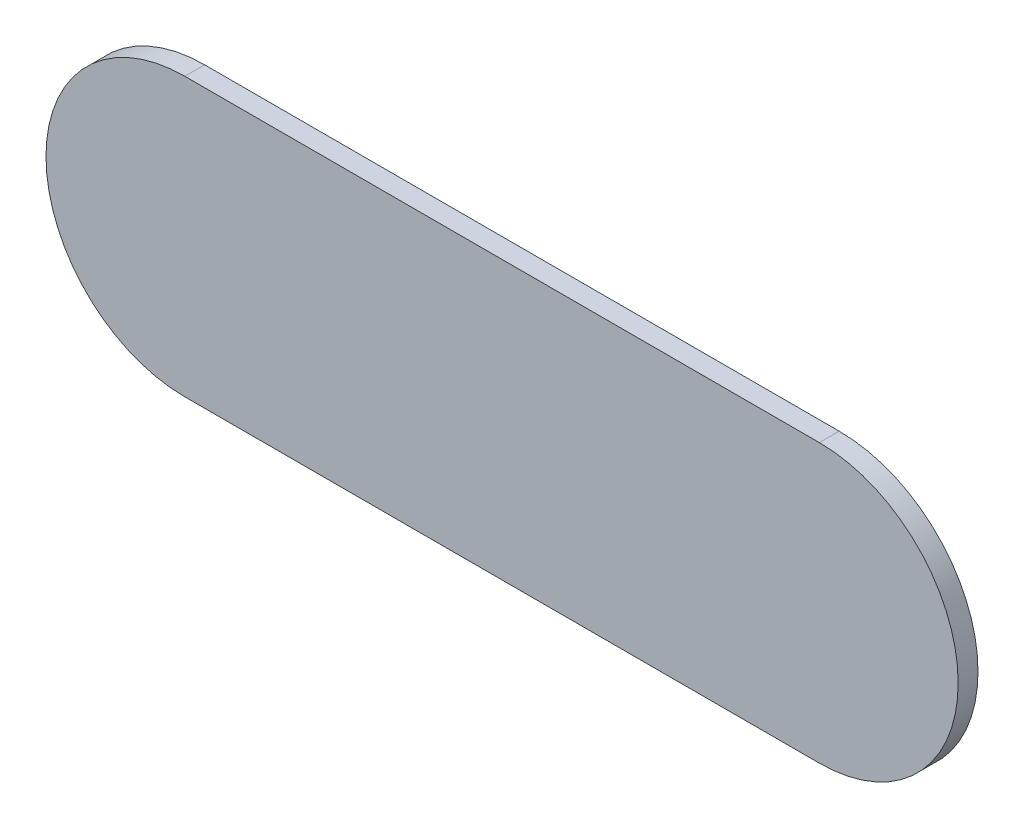
ISO-10303-21;
HEADER;
FILE_DESCRIPTION(('STEP AP214'),'2;1');
FILE_NAME('part.step','',(''),(''),'','','');
FILE_SCHEMA(('AUTOMOTIVE_DESIGN { 1 0 10303 214 1 1 1 1 }'));
ENDSEC;
DATA;
#1=APPLICATION_CONTEXT('core data for automotive mechanical design processes');
#2=APPLICATION_PROTOCOL_DEFINITION('international standard','automotive_design',2000,#1);
#3=PRODUCT_CONTEXT('',#1,'mechanical');
#4=PRODUCT('Part','Part','',(#3));
#5=PRODUCT_RELATED_PRODUCT_CATEGORY('part','',(#4));
#6=PRODUCT_DEFINITION_FORMATION('','',#4);
#7=PRODUCT_DEFINITION_CONTEXT('part definition',#1,'design');
#8=PRODUCT_DEFINITION('design','',#6,#7);
#9=PRODUCT_DEFINITION_SHAPE('','',#8);
#10=(LENGTH_UNIT() NAMED_UNIT(*) SI_UNIT(.MILLI.,.METRE.));
#11=(NAMED_UNIT(*) PLANE_ANGLE_UNIT() SI_UNIT($,.RADIAN.));
#12=(NAMED_UNIT(*) SI_UNIT($,.STERADIAN.) SOLID_ANGLE_UNIT());
#13=UNCERTAINTY_MEASURE_WITH_UNIT(LENGTH_MEASURE(1.E-05),#10,'distance_accuracy_value','');
#14=(GEOMETRIC_REPRESENTATION_CONTEXT(3) GLOBAL_UNCERTAINTY_ASSIGNED_CONTEXT((#13)) GLOBAL_UNIT_ASSIGNED_CONTEXT((#10,
#11,#12)) REPRESENTATION_CONTEXT('',''));
#15=CARTESIAN_POINT('',(0.,0.,0.));
#16=DIRECTION('',(0.,0.,1.));
#17=DIRECTION('',(1.,0.,0.));
#18=AXIS2_PLACEMENT_3D('',#15,#16,#17);
#19=CARTESIAN_POINT('',(0.,0.,1.5875));
#20=DIRECTION('',(0.,0.,-1.));
#21=DIRECTION('',(-1.,0.,0.));
#22=AXIS2_PLACEMENT_3D('',#19,#20,#21);
#23=CYLINDRICAL_SURFACE('',#22,11.1125);
#24=CARTESIAN_POINT('',(0.,0.,0.));
#25=DIRECTION('',(0.,0.,1.));
#26=DIRECTION('',(1.,0.,0.));
#27=AXIS2_PLACEMENT_3D('',#24,#25,#26);
#28=CIRCLE('',#27,11.1125);
#29=CARTESIAN_POINT('',(0.,11.1125,0.));
#30=VERTEX_POINT('',#29);
#31=CARTESIAN_POINT('',(0.,-11.1125,0.));
#32=VERTEX_POINT('',#31);
#33=EDGE_CURVE('E99',#30,#32,#28,.T.);
#34=ORIENTED_EDGE('',*,*,#33,.T.);
#35=DIRECTION('',(0.,0.,-1.));
#36=VECTOR('',#35,1.);
#37=CARTESIAN_POINT('',(0.,-11.1125,1.5875));
#38=LINE('',#37,#36);
#39=CARTESIAN_POINT('',(0.,-11.1125,1.5875));
#40=VERTEX_POINT('',#39);
#41=EDGE_CURVE('E11',#40,#32,#38,.T.);
#42=ORIENTED_EDGE('',*,*,#41,.F.);
#43=CARTESIAN_POINT('',(0.,0.,1.5875));
#44=DIRECTION('',(0.,0.,1.));
#45=DIRECTION('',(1.,0.,0.));
#46=AXIS2_PLACEMENT_3D('',#43,#44,#45);
#47=CIRCLE('',#46,11.1125);
#48=CARTESIAN_POINT('',(0.,11.1125,1.5875));
#49=VERTEX_POINT('',#48);
#50=EDGE_CURVE('E87',#49,#40,#47,.T.);
#51=ORIENTED_EDGE('',*,*,#50,.F.);
#52=DIRECTION('',(0.,0.,-1.));
#53=VECTOR('',#52,1.);
#54=CARTESIAN_POINT('',(0.,11.1125,1.5875));
#55=LINE('',#54,#53);
#56=EDGE_CURVE('E95',#49,#30,#55,.T.);
#57=ORIENTED_EDGE('',*,*,#56,.T.);
#58=EDGE_LOOP('',(#34,#42,#51,#57));
#59=FACE_BOUND('',#58,.T.);
#60=ADVANCED_FACE('F36',(#59),#23,.T.);
#61=CARTESIAN_POINT('',(0.,-11.1125,1.5875));
#62=DIRECTION('',(0.,1.,0.));
#63=DIRECTION('',(0.,0.,1.));
#64=AXIS2_PLACEMENT_3D('',#61,#62,#63);
#65=PLANE('',#64);
#66=DIRECTION('',(1.,0.,0.));
#67=VECTOR('',#66,1.);
#68=CARTESIAN_POINT('',(0.,-11.1125,0.));
#69=LINE('',#68,#67);
#70=CARTESIAN_POINT('',(50.8,-11.1125,0.));
#71=VERTEX_POINT('',#70);
#72=EDGE_CURVE('E91',#32,#71,#69,.T.);
#73=ORIENTED_EDGE('',*,*,#72,.T.);
#74=DIRECTION('',(0.,0.,-1.));
#75=VECTOR('',#74,1.);
#76=CARTESIAN_POINT('',(50.8,-11.1125,1.5875));
#77=LINE('',#76,#75);
#78=CARTESIAN_POINT('',(50.8,-11.1125,1.5875));
#79=VERTEX_POINT('',#78);
#80=EDGE_CURVE('E44',#79,#71,#77,.T.);
#81=ORIENTED_EDGE('',*,*,#80,.F.);
#82=DIRECTION('',(1.,0.,0.));
#83=VECTOR('',#82,1.);
#84=CARTESIAN_POINT('',(0.,-11.1125,1.5875));
#85=LINE('',#84,#83);
#86=EDGE_CURVE('E82',#40,#79,#85,.T.);
#87=ORIENTED_EDGE('',*,*,#86,.F.);
#88=ORIENTED_EDGE('',*,*,#41,.T.);
#89=EDGE_LOOP('',(#73,#81,#87,#88));
#90=FACE_BOUND('',#89,.T.);
#91=ADVANCED_FACE('F90',(#90),#65,.F.);
#92=CARTESIAN_POINT('',(50.8,0.,1.5875));
#93=DIRECTION('',(0.,0.,-1.));
#94=DIRECTION('',(-1.,0.,0.));
#95=AXIS2_PLACEMENT_3D('',#92,#93,#94);
#96=CYLINDRICAL_SURFACE('',#95,11.1125);
#97=CARTESIAN_POINT('',(50.8,0.,0.));
#98=DIRECTION('',(0.,0.,1.));
#99=DIRECTION('',(1.,0.,0.));
#100=AXIS2_PLACEMENT_3D('',#97,#98,#99);
#101=CIRCLE('',#100,11.1125);
#102=CARTESIAN_POINT('',(50.8,11.1125,0.));
#103=VERTEX_POINT('',#102);
#104=EDGE_CURVE('E69',#71,#103,#101,.T.);
#105=ORIENTED_EDGE('',*,*,#104,.T.);
#106=DIRECTION('',(0.,0.,-1.));
#107=VECTOR('',#106,1.);
#108=CARTESIAN_POINT('',(50.8,11.1125,1.5875));
#109=LINE('',#108,#107);
#110=CARTESIAN_POINT('',(50.8,11.1125,1.5875));
#111=VERTEX_POINT('',#110);
#112=EDGE_CURVE('E92',#111,#103,#109,.T.);
#113=ORIENTED_EDGE('',*,*,#112,.F.);
#114=CARTESIAN_POINT('',(50.8,0.,1.5875));
#115=DIRECTION('',(0.,0.,1.));
#116=DIRECTION('',(1.,0.,0.));
#117=AXIS2_PLACEMENT_3D('',#114,#115,#116);
#118=CIRCLE('',#117,11.1125);
#119=EDGE_CURVE('E85',#79,#111,#118,.T.);
#120=ORIENTED_EDGE('',*,*,#119,.F.);
#121=ORIENTED_EDGE('',*,*,#80,.T.);
#122=EDGE_LOOP('',(#105,#113,#120,#121));
#123=FACE_BOUND('',#122,.T.);
#124=ADVANCED_FACE('F93',(#123),#96,.T.);
#125=CARTESIAN_POINT('',(0.,11.1125,1.5875));
#126=DIRECTION('',(0.,-1.,0.));
#127=DIRECTION('',(0.,0.,-1.));
#128=AXIS2_PLACEMENT_3D('',#125,#126,#127);
#129=PLANE('',#128);
#130=DIRECTION('',(-1.,0.,0.));
#131=VECTOR('',#130,1.);
#132=CARTESIAN_POINT('',(0.,11.1125,0.));
#133=LINE('',#132,#131);
#134=EDGE_CURVE('E75',#103,#30,#133,.T.);
#135=ORIENTED_EDGE('',*,*,#134,.T.);
#136=ORIENTED_EDGE('',*,*,#56,.F.);
#137=DIRECTION('',(-1.,0.,0.));
#138=VECTOR('',#137,1.);
#139=CARTESIAN_POINT('',(0.,11.1125,1.5875));
#140=LINE('',#139,#138);
#141=EDGE_CURVE('E52',#111,#49,#140,.T.);
#142=ORIENTED_EDGE('',*,*,#141,.F.);
#143=ORIENTED_EDGE('',*,*,#112,.T.);
#144=EDGE_LOOP('',(#135,#136,#142,#143));
#145=FACE_BOUND('',#144,.T.);
#146=ADVANCED_FACE('F106',(#145),#129,.F.);
#147=CARTESIAN_POINT('',(0.,0.,1.5875));
#148=DIRECTION('',(0.,0.,1.));
#149=DIRECTION('',(1.,0.,0.));
#150=AXIS2_PLACEMENT_3D('',#147,#148,#149);
#151=PLANE('',#150);
#152=ORIENTED_EDGE('',*,*,#50,.T.);
#153=ORIENTED_EDGE('',*,*,#86,.T.);
#154=ORIENTED_EDGE('',*,*,#119,.T.);
#155=ORIENTED_EDGE('',*,*,#141,.T.);
#156=EDGE_LOOP('',(#152,#153,#154,#155));
#157=FACE_BOUND('',#156,.T.);
#158=ADVANCED_FACE('F83',(#157),#151,.T.);
#159=CARTESIAN_POINT('',(0.,0.,0.));
#160=DIRECTION('',(0.,0.,1.));
#161=DIRECTION('',(1.,0.,0.));
#162=AXIS2_PLACEMENT_3D('',#159,#160,#161);
#163=PLANE('',#162);
#164=ORIENTED_EDGE('',*,*,#33,.F.);
#165=ORIENTED_EDGE('',*,*,#134,.F.);
#166=ORIENTED_EDGE('',*,*,#104,.F.);
#167=ORIENTED_EDGE('',*,*,#72,.F.);
#168=EDGE_LOOP('',(#164,#165,#166,#167));
#169=FACE_BOUND('',#168,.T.);
#170=ADVANCED_FACE('F109',(#169),#163,.F.);
#171=CLOSED_SHELL('',(#60,#91,#124,#146,#158,#170));
#172=MANIFOLD_SOLID_BREP('B2',#171);
#173=ADVANCED_BREP_SHAPE_REPRESENTATION('',(#18,#172),#14);
#174=SHAPE_DEFINITION_REPRESENTATION(#9,#173);
ENDSEC;
END-ISO-10303-21;
